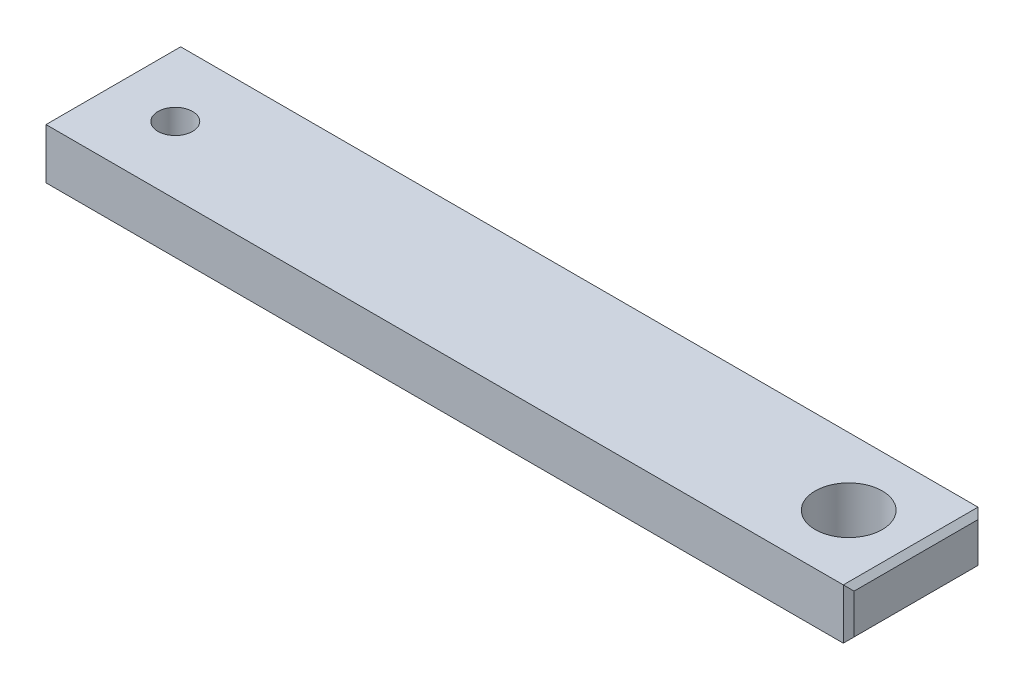
ISO-10303-21;
HEADER;
FILE_DESCRIPTION(('STEP AP214'),'2;1');
FILE_NAME('part.step','',(''),(''),'','','');
FILE_SCHEMA(('AUTOMOTIVE_DESIGN { 1 0 10303 214 1 1 1 1 }'));
ENDSEC;
DATA;
#1=APPLICATION_CONTEXT('core data for automotive mechanical design processes');
#2=APPLICATION_PROTOCOL_DEFINITION('international standard','automotive_design',2000,#1);
#3=PRODUCT_CONTEXT('',#1,'mechanical');
#4=PRODUCT('Part','Part','',(#3));
#5=PRODUCT_RELATED_PRODUCT_CATEGORY('part','',(#4));
#6=PRODUCT_DEFINITION_FORMATION('','',#4);
#7=PRODUCT_DEFINITION_CONTEXT('part definition',#1,'design');
#8=PRODUCT_DEFINITION('design','',#6,#7);
#9=PRODUCT_DEFINITION_SHAPE('','',#8);
#10=(LENGTH_UNIT() NAMED_UNIT(*) SI_UNIT(.MILLI.,.METRE.));
#11=(NAMED_UNIT(*) PLANE_ANGLE_UNIT() SI_UNIT($,.RADIAN.));
#12=(NAMED_UNIT(*) SI_UNIT($,.STERADIAN.) SOLID_ANGLE_UNIT());
#13=UNCERTAINTY_MEASURE_WITH_UNIT(LENGTH_MEASURE(1.E-05),#10,'distance_accuracy_value','');
#14=(GEOMETRIC_REPRESENTATION_CONTEXT(3) GLOBAL_UNCERTAINTY_ASSIGNED_CONTEXT((#13)) GLOBAL_UNIT_ASSIGNED_CONTEXT((#10,
#11,#12)) REPRESENTATION_CONTEXT('',''));
#15=CARTESIAN_POINT('',(0.,0.,0.));
#16=DIRECTION('',(0.,0.,1.));
#17=DIRECTION('',(1.,0.,0.));
#18=AXIS2_PLACEMENT_3D('',#15,#16,#17);
#19=CARTESIAN_POINT('',(0.,4.7625,6.34999999999999));
#20=DIRECTION('',(0.,0.,-1.));
#21=DIRECTION('',(-1.,0.,0.));
#22=AXIS2_PLACEMENT_3D('',#19,#20,#21);
#23=PLANE('',#22);
#24=DIRECTION('',(1.,0.,0.));
#25=VECTOR('',#24,1.);
#26=CARTESIAN_POINT('',(0.,4.7625,6.34999999999999));
#27=LINE('',#26,#25);
#28=CARTESIAN_POINT('',(-69.342,4.7625,6.34999999999999));
#29=VERTEX_POINT('',#28);
#30=CARTESIAN_POINT('',(5.84199999999999,4.7625,6.34999999999999));
#31=VERTEX_POINT('',#30);
#32=EDGE_CURVE('E185',#29,#31,#27,.T.);
#33=ORIENTED_EDGE('',*,*,#32,.F.);
#34=DIRECTION('',(0.,-1.,0.));
#35=VECTOR('',#34,1.);
#36=CARTESIAN_POINT('',(-69.342,4.7625,6.34999999999999));
#37=LINE('',#36,#35);
#38=CARTESIAN_POINT('',(-69.342,0.,6.34999999999999));
#39=VERTEX_POINT('',#38);
#40=EDGE_CURVE('E143',#29,#39,#37,.T.);
#41=ORIENTED_EDGE('',*,*,#40,.T.);
#42=DIRECTION('',(1.,0.,0.));
#43=VECTOR('',#42,1.);
#44=CARTESIAN_POINT('',(0.,0.,6.34999999999999));
#45=LINE('',#44,#43);
#46=CARTESIAN_POINT('',(5.84199999999999,0.,6.34999999999999));
#47=VERTEX_POINT('',#46);
#48=EDGE_CURVE('E186',#39,#47,#45,.T.);
#49=ORIENTED_EDGE('',*,*,#48,.T.);
#50=DIRECTION('',(0.,1.,0.));
#51=VECTOR('',#50,1.);
#52=CARTESIAN_POINT('',(5.84199999999999,4.7625,6.34999999999999));
#53=LINE('',#52,#51);
#54=EDGE_CURVE('E140',#47,#31,#53,.T.);
#55=ORIENTED_EDGE('',*,*,#54,.T.);
#56=EDGE_LOOP('',(#33,#41,#49,#55));
#57=FACE_BOUND('',#56,.T.);
#58=ADVANCED_FACE('F38',(#57),#23,.F.);
#59=CARTESIAN_POINT('',(6.34999999999999,4.7625,0.));
#60=DIRECTION('',(1.,0.,0.));
#61=DIRECTION('',(0.,0.,-1.));
#62=AXIS2_PLACEMENT_3D('',#59,#60,#61);
#63=PLANE('',#62);
#64=DIRECTION('',(0.,0.,1.));
#65=VECTOR('',#64,1.);
#66=CARTESIAN_POINT('',(6.34999999999999,4.25449999999999,0.));
#67=LINE('',#66,#65);
#68=CARTESIAN_POINT('',(6.34999999999999,4.25449999999999,-5.84199999999999));
#69=VERTEX_POINT('',#68);
#70=CARTESIAN_POINT('',(6.34999999999997,4.25449999999999,5.84199999999999));
#71=VERTEX_POINT('',#70);
#72=EDGE_CURVE('E47',#69,#71,#67,.T.);
#73=ORIENTED_EDGE('',*,*,#72,.T.);
#74=DIRECTION('',(0.,-1.,0.));
#75=VECTOR('',#74,1.);
#76=CARTESIAN_POINT('',(6.34999999999997,0.,5.84199999999999));
#77=LINE('',#76,#75);
#78=CARTESIAN_POINT('',(6.34999999999997,0.508000000000008,5.84199999999999));
#79=VERTEX_POINT('',#78);
#80=EDGE_CURVE('E11',#71,#79,#77,.T.);
#81=ORIENTED_EDGE('',*,*,#80,.T.);
#82=DIRECTION('',(0.,0.,-1.));
#83=VECTOR('',#82,1.);
#84=CARTESIAN_POINT('',(6.34999999999999,0.508000000000008,-6.34999999999999));
#85=LINE('',#84,#83);
#86=CARTESIAN_POINT('',(6.34999999999999,0.508000000000008,-5.84199999999999));
#87=VERTEX_POINT('',#86);
#88=EDGE_CURVE('E149',#79,#87,#85,.T.);
#89=ORIENTED_EDGE('',*,*,#88,.T.);
#90=DIRECTION('',(0.,1.,0.));
#91=VECTOR('',#90,1.);
#92=CARTESIAN_POINT('',(6.34999999999999,4.7625,-5.84199999999999));
#93=LINE('',#92,#91);
#94=EDGE_CURVE('E58',#87,#69,#93,.T.);
#95=ORIENTED_EDGE('',*,*,#94,.T.);
#96=EDGE_LOOP('',(#73,#81,#89,#95));
#97=FACE_BOUND('',#96,.T.);
#98=ADVANCED_FACE('F238',(#97),#63,.T.);
#99=CARTESIAN_POINT('',(0.,4.7625,-6.34999999999999));
#100=DIRECTION('',(0.,0.,-1.));
#101=DIRECTION('',(-1.,0.,0.));
#102=AXIS2_PLACEMENT_3D('',#99,#100,#101);
#103=PLANE('',#102);
#104=DIRECTION('',(1.,0.,0.));
#105=VECTOR('',#104,1.);
#106=CARTESIAN_POINT('',(0.,0.,-6.34999999999999));
#107=LINE('',#106,#105);
#108=CARTESIAN_POINT('',(-69.342,0.,-6.34999999999999));
#109=VERTEX_POINT('',#108);
#110=CARTESIAN_POINT('',(5.84199999999999,0.,-6.34999999999999));
#111=VERTEX_POINT('',#110);
#112=EDGE_CURVE('E179',#109,#111,#107,.T.);
#113=ORIENTED_EDGE('',*,*,#112,.F.);
#114=DIRECTION('',(0.,1.,0.));
#115=VECTOR('',#114,1.);
#116=CARTESIAN_POINT('',(-69.342,4.7625,-6.34999999999999));
#117=LINE('',#116,#115);
#118=CARTESIAN_POINT('',(-69.342,4.7625,-6.34999999999999));
#119=VERTEX_POINT('',#118);
#120=EDGE_CURVE('E110',#109,#119,#117,.T.);
#121=ORIENTED_EDGE('',*,*,#120,.T.);
#122=DIRECTION('',(1.,0.,0.));
#123=VECTOR('',#122,1.);
#124=CARTESIAN_POINT('',(0.,4.7625,-6.34999999999999));
#125=LINE('',#124,#123);
#126=CARTESIAN_POINT('',(5.84199999999999,4.7625,-6.34999999999999));
#127=VERTEX_POINT('',#126);
#128=EDGE_CURVE('E123',#119,#127,#125,.T.);
#129=ORIENTED_EDGE('',*,*,#128,.T.);
#130=DIRECTION('',(0.,-1.,0.));
#131=VECTOR('',#130,1.);
#132=CARTESIAN_POINT('',(5.84199999999999,4.7625,-6.34999999999999));
#133=LINE('',#132,#131);
#134=EDGE_CURVE('E129',#127,#111,#133,.T.);
#135=ORIENTED_EDGE('',*,*,#134,.T.);
#136=EDGE_LOOP('',(#113,#121,#129,#135));
#137=FACE_BOUND('',#136,.T.);
#138=ADVANCED_FACE('F178',(#137),#103,.T.);
#139=CARTESIAN_POINT('',(-69.85,4.7625,0.));
#140=DIRECTION('',(1.,0.,0.));
#141=DIRECTION('',(0.,0.,-1.));
#142=AXIS2_PLACEMENT_3D('',#139,#140,#141);
#143=PLANE('',#142);
#144=DIRECTION('',(0.,0.,-1.));
#145=VECTOR('',#144,1.);
#146=CARTESIAN_POINT('',(-69.85,4.2545,-6.35000000000001));
#147=LINE('',#146,#145);
#148=CARTESIAN_POINT('',(-69.85,4.2545,5.84200000000001));
#149=VERTEX_POINT('',#148);
#150=CARTESIAN_POINT('',(-69.85,4.2545,-5.842));
#151=VERTEX_POINT('',#150);
#152=EDGE_CURVE('E127',#149,#151,#147,.T.);
#153=ORIENTED_EDGE('',*,*,#152,.T.);
#154=DIRECTION('',(0.,-1.,0.));
#155=VECTOR('',#154,1.);
#156=CARTESIAN_POINT('',(-69.85,0.,-5.842));
#157=LINE('',#156,#155);
#158=CARTESIAN_POINT('',(-69.85,0.507999999999995,-5.842));
#159=VERTEX_POINT('',#158);
#160=EDGE_CURVE('E108',#151,#159,#157,.T.);
#161=ORIENTED_EDGE('',*,*,#160,.T.);
#162=DIRECTION('',(0.,0.,1.));
#163=VECTOR('',#162,1.);
#164=CARTESIAN_POINT('',(-69.85,0.507999999999995,0.));
#165=LINE('',#164,#163);
#166=CARTESIAN_POINT('',(-69.85,0.507999999999995,5.84200000000001));
#167=VERTEX_POINT('',#166);
#168=EDGE_CURVE('E116',#159,#167,#165,.T.);
#169=ORIENTED_EDGE('',*,*,#168,.T.);
#170=DIRECTION('',(0.,1.,0.));
#171=VECTOR('',#170,1.);
#172=CARTESIAN_POINT('',(-69.85,4.7625,5.84200000000001));
#173=LINE('',#172,#171);
#174=EDGE_CURVE('E122',#167,#149,#173,.T.);
#175=ORIENTED_EDGE('',*,*,#174,.T.);
#176=EDGE_LOOP('',(#153,#161,#169,#175));
#177=FACE_BOUND('',#176,.T.);
#178=ADVANCED_FACE('F125',(#177),#143,.F.);
#179=CARTESIAN_POINT('',(0.,4.7625,0.));
#180=DIRECTION('',(0.,1.,0.));
#181=DIRECTION('',(0.,0.,1.));
#182=AXIS2_PLACEMENT_3D('',#179,#180,#181);
#183=PLANE('',#182);
#184=CARTESIAN_POINT('',(0.,4.7625,0.));
#185=DIRECTION('',(0.,1.,0.));
#186=DIRECTION('',(0.,0.,1.));
#187=AXIS2_PLACEMENT_3D('',#184,#185,#186);
#188=CIRCLE('',#187,3.1623);
#189=CARTESIAN_POINT('',(0.,4.7625,3.1623));
#190=VERTEX_POINT('',#189);
#191=EDGE_CURVE('E158',#190,#190,#188,.T.);
#192=ORIENTED_EDGE('',*,*,#191,.F.);
#193=EDGE_LOOP('',(#192));
#194=FACE_BOUND('',#193,.T.);
#195=CARTESIAN_POINT('',(-63.5,4.7625,0.));
#196=DIRECTION('',(0.,1.,0.));
#197=DIRECTION('',(0.,0.,1.));
#198=AXIS2_PLACEMENT_3D('',#195,#196,#197);
#199=CIRCLE('',#198,1.63195);
#200=CARTESIAN_POINT('',(-63.5,4.7625,1.63195));
#201=VERTEX_POINT('',#200);
#202=EDGE_CURVE('E206',#201,#201,#199,.T.);
#203=ORIENTED_EDGE('',*,*,#202,.F.);
#204=EDGE_LOOP('',(#203));
#205=FACE_BOUND('',#204,.T.);
#206=ORIENTED_EDGE('',*,*,#128,.F.);
#207=DIRECTION('',(0.,0.,1.));
#208=VECTOR('',#207,1.);
#209=CARTESIAN_POINT('',(-69.342,4.7625,6.34999999999999));
#210=LINE('',#209,#208);
#211=EDGE_CURVE('E138',#119,#29,#210,.T.);
#212=ORIENTED_EDGE('',*,*,#211,.T.);
#213=ORIENTED_EDGE('',*,*,#32,.T.);
#214=DIRECTION('',(0.,0.,-1.));
#215=VECTOR('',#214,1.);
#216=CARTESIAN_POINT('',(5.84200000000001,4.7625,0.));
#217=LINE('',#216,#215);
#218=EDGE_CURVE('E136',#31,#127,#217,.T.);
#219=ORIENTED_EDGE('',*,*,#218,.T.);
#220=EDGE_LOOP('',(#206,#212,#213,#219));
#221=FACE_BOUND('',#220,.T.);
#222=ADVANCED_FACE('F202',(#194,#205,#221),#183,.T.);
#223=CARTESIAN_POINT('',(0.,0.,0.));
#224=DIRECTION('',(0.,1.,0.));
#225=DIRECTION('',(0.,0.,1.));
#226=AXIS2_PLACEMENT_3D('',#223,#224,#225);
#227=PLANE('',#226);
#228=CARTESIAN_POINT('',(0.,0.,0.));
#229=DIRECTION('',(0.,1.,0.));
#230=DIRECTION('',(0.,0.,1.));
#231=AXIS2_PLACEMENT_3D('',#228,#229,#230);
#232=CIRCLE('',#231,3.1623);
#233=CARTESIAN_POINT('',(0.,0.,3.1623));
#234=VERTEX_POINT('',#233);
#235=EDGE_CURVE('E209',#234,#234,#232,.T.);
#236=ORIENTED_EDGE('',*,*,#235,.T.);
#237=EDGE_LOOP('',(#236));
#238=FACE_BOUND('',#237,.T.);
#239=CARTESIAN_POINT('',(-63.5,0.,0.));
#240=DIRECTION('',(0.,1.,0.));
#241=DIRECTION('',(0.,0.,1.));
#242=AXIS2_PLACEMENT_3D('',#239,#240,#241);
#243=CIRCLE('',#242,1.63195);
#244=CARTESIAN_POINT('',(-63.5,0.,1.63195));
#245=VERTEX_POINT('',#244);
#246=EDGE_CURVE('E190',#245,#245,#243,.T.);
#247=ORIENTED_EDGE('',*,*,#246,.T.);
#248=EDGE_LOOP('',(#247));
#249=FACE_BOUND('',#248,.T.);
#250=ORIENTED_EDGE('',*,*,#48,.F.);
#251=DIRECTION('',(0.,0.,-1.));
#252=VECTOR('',#251,1.);
#253=CARTESIAN_POINT('',(-69.342,0.,0.));
#254=LINE('',#253,#252);
#255=EDGE_CURVE('E147',#39,#109,#254,.T.);
#256=ORIENTED_EDGE('',*,*,#255,.T.);
#257=ORIENTED_EDGE('',*,*,#112,.T.);
#258=DIRECTION('',(0.,0.,1.));
#259=VECTOR('',#258,1.);
#260=CARTESIAN_POINT('',(5.84199999999999,0.,6.34999999999999));
#261=LINE('',#260,#259);
#262=EDGE_CURVE('E145',#111,#47,#261,.T.);
#263=ORIENTED_EDGE('',*,*,#262,.T.);
#264=EDGE_LOOP('',(#250,#256,#257,#263));
#265=FACE_BOUND('',#264,.T.);
#266=ADVANCED_FACE('F183',(#238,#249,#265),#227,.F.);
#267=CARTESIAN_POINT('',(-63.5,4.7625,0.));
#268=DIRECTION('',(0.,1.,0.));
#269=DIRECTION('',(0.,0.,1.));
#270=AXIS2_PLACEMENT_3D('',#267,#268,#269);
#271=CYLINDRICAL_SURFACE('',#270,1.63195);
#272=ORIENTED_EDGE('',*,*,#246,.F.);
#273=EDGE_LOOP('',(#272));
#274=FACE_BOUND('',#273,.T.);
#275=ORIENTED_EDGE('',*,*,#202,.T.);
#276=EDGE_LOOP('',(#275));
#277=FACE_BOUND('',#276,.T.);
#278=ADVANCED_FACE('F220',(#274,#277),#271,.F.);
#279=CARTESIAN_POINT('',(0.,0.,0.));
#280=DIRECTION('',(0.,1.,0.));
#281=DIRECTION('',(0.,0.,1.));
#282=AXIS2_PLACEMENT_3D('',#279,#280,#281);
#283=CYLINDRICAL_SURFACE('',#282,3.1623);
#284=ORIENTED_EDGE('',*,*,#235,.F.);
#285=EDGE_LOOP('',(#284));
#286=FACE_BOUND('',#285,.T.);
#287=ORIENTED_EDGE('',*,*,#191,.T.);
#288=EDGE_LOOP('',(#287));
#289=FACE_BOUND('',#288,.T.);
#290=ADVANCED_FACE('F217',(#286,#289),#283,.F.);
#291=CARTESIAN_POINT('',(-69.342,4.7625,6.34999999999999));
#292=DIRECTION('',(0.707106781186538,0.,-0.707106781186556));
#293=DIRECTION('',(0.,-1.,0.));
#294=AXIS2_PLACEMENT_3D('',#291,#292,#293);
#295=PLANE('',#294);
#296=DIRECTION('',(-0.577350269189631,0.577350269189631,-0.577350269189616));
#297=VECTOR('',#296,1.);
#298=CARTESIAN_POINT('',(-71.7973333333333,2.45533333333331,3.89466666666674));
#299=LINE('',#298,#297);
#300=EDGE_CURVE('E119',#39,#167,#299,.T.);
#301=ORIENTED_EDGE('',*,*,#300,.F.);
#302=ORIENTED_EDGE('',*,*,#40,.F.);
#303=DIRECTION('',(0.577350269189631,0.577350269189631,0.577350269189616));
#304=VECTOR('',#303,1.);
#305=CARTESIAN_POINT('',(-69.342,4.76250000000001,6.34999999999999));
#306=LINE('',#305,#304);
#307=EDGE_CURVE('E155',#149,#29,#306,.T.);
#308=ORIENTED_EDGE('',*,*,#307,.F.);
#309=ORIENTED_EDGE('',*,*,#174,.F.);
#310=EDGE_LOOP('',(#301,#302,#308,#309));
#311=FACE_BOUND('',#310,.T.);
#312=ADVANCED_FACE('F196',(#311),#295,.F.);
#313=CARTESIAN_POINT('',(-69.342,4.7625,0.));
#314=DIRECTION('',(-0.707106781186548,0.707106781186547,0.));
#315=DIRECTION('',(0.,0.,-1.));
#316=AXIS2_PLACEMENT_3D('',#313,#314,#315);
#317=PLANE('',#316);
#318=ORIENTED_EDGE('',*,*,#307,.T.);
#319=ORIENTED_EDGE('',*,*,#211,.F.);
#320=DIRECTION('',(-0.577350269189631,-0.577350269189631,0.577350269189616));
#321=VECTOR('',#320,1.);
#322=CARTESIAN_POINT('',(-71.4586666666666,2.64583333333335,-4.23333333333339));
#323=LINE('',#322,#321);
#324=EDGE_CURVE('E113',#151,#119,#323,.F.);
#325=ORIENTED_EDGE('',*,*,#324,.F.);
#326=ORIENTED_EDGE('',*,*,#152,.F.);
#327=EDGE_LOOP('',(#318,#319,#325,#326));
#328=FACE_BOUND('',#327,.T.);
#329=ADVANCED_FACE('F199',(#328),#317,.T.);
#330=CARTESIAN_POINT('',(-69.85,0.507999999999995,0.));
#331=DIRECTION('',(0.707106781186548,0.707106781186547,0.));
#332=DIRECTION('',(0.,0.,1.));
#333=AXIS2_PLACEMENT_3D('',#330,#331,#332);
#334=PLANE('',#333);
#335=ORIENTED_EDGE('',*,*,#300,.T.);
#336=ORIENTED_EDGE('',*,*,#168,.F.);
#337=DIRECTION('',(-0.577350269189631,0.577350269189631,0.577350269189616));
#338=VECTOR('',#337,1.);
#339=CARTESIAN_POINT('',(-71.7973333333333,2.45533333333331,-3.89466666666674));
#340=LINE('',#339,#338);
#341=EDGE_CURVE('E104',#109,#159,#340,.T.);
#342=ORIENTED_EDGE('',*,*,#341,.F.);
#343=ORIENTED_EDGE('',*,*,#255,.F.);
#344=EDGE_LOOP('',(#335,#336,#342,#343));
#345=FACE_BOUND('',#344,.T.);
#346=ADVANCED_FACE('F117',(#345),#334,.F.);
#347=CARTESIAN_POINT('',(-69.85,4.7625,-5.842));
#348=DIRECTION('',(-0.707106781186538,0.,-0.707106781186556));
#349=DIRECTION('',(0.,1.,0.));
#350=AXIS2_PLACEMENT_3D('',#347,#348,#349);
#351=PLANE('',#350);
#352=ORIENTED_EDGE('',*,*,#324,.T.);
#353=ORIENTED_EDGE('',*,*,#120,.F.);
#354=ORIENTED_EDGE('',*,*,#341,.T.);
#355=ORIENTED_EDGE('',*,*,#160,.F.);
#356=EDGE_LOOP('',(#352,#353,#354,#355));
#357=FACE_BOUND('',#356,.T.);
#358=ADVANCED_FACE('F106',(#357),#351,.T.);
#359=CARTESIAN_POINT('',(5.84199999999999,4.7625,-6.34999999999999));
#360=DIRECTION('',(-0.707106781186552,0.,0.707106781186543));
#361=DIRECTION('',(0.,-1.,0.));
#362=AXIS2_PLACEMENT_3D('',#359,#360,#361);
#363=PLANE('',#362);
#364=DIRECTION('',(-0.57735026918962,-0.577350269189628,-0.577350269189628));
#365=VECTOR('',#364,1.);
#366=CARTESIAN_POINT('',(7.95866666666664,2.11666666666669,-4.23333333333331));
#367=LINE('',#366,#365);
#368=EDGE_CURVE('E162',#111,#87,#367,.F.);
#369=ORIENTED_EDGE('',*,*,#368,.F.);
#370=ORIENTED_EDGE('',*,*,#134,.F.);
#371=DIRECTION('',(0.57735026918962,-0.577350269189628,0.577350269189628));
#372=VECTOR('',#371,1.);
#373=CARTESIAN_POINT('',(5.84199999999999,4.7625,-6.34999999999999));
#374=LINE('',#373,#372);
#375=EDGE_CURVE('E42',#69,#127,#374,.F.);
#376=ORIENTED_EDGE('',*,*,#375,.F.);
#377=ORIENTED_EDGE('',*,*,#94,.F.);
#378=EDGE_LOOP('',(#369,#370,#376,#377));
#379=FACE_BOUND('',#378,.T.);
#380=ADVANCED_FACE('F40',(#379),#363,.F.);
#381=CARTESIAN_POINT('',(6.34999999999999,4.25449999999999,0.));
#382=DIRECTION('',(-0.707106781186552,-0.707106781186543,0.));
#383=DIRECTION('',(0.,0.,1.));
#384=AXIS2_PLACEMENT_3D('',#381,#382,#383);
#385=PLANE('',#384);
#386=ORIENTED_EDGE('',*,*,#375,.T.);
#387=ORIENTED_EDGE('',*,*,#218,.F.);
#388=DIRECTION('',(-0.57735026918962,0.577350269189628,0.577350269189628));
#389=VECTOR('',#388,1.);
#390=CARTESIAN_POINT('',(8.29733333333332,2.30716666666664,3.89466666666664));
#391=LINE('',#390,#389);
#392=EDGE_CURVE('E161',#71,#31,#391,.T.);
#393=ORIENTED_EDGE('',*,*,#392,.F.);
#394=ORIENTED_EDGE('',*,*,#72,.F.);
#395=EDGE_LOOP('',(#386,#387,#393,#394));
#396=FACE_BOUND('',#395,.T.);
#397=ADVANCED_FACE('F171',(#396),#385,.F.);
#398=CARTESIAN_POINT('',(5.84200000000001,0.,0.));
#399=DIRECTION('',(0.707106781186552,-0.707106781186543,0.));
#400=DIRECTION('',(0.,0.,-1.));
#401=AXIS2_PLACEMENT_3D('',#398,#399,#400);
#402=PLANE('',#401);
#403=ORIENTED_EDGE('',*,*,#368,.T.);
#404=ORIENTED_EDGE('',*,*,#88,.F.);
#405=DIRECTION('',(-0.57735026918962,-0.577350269189628,0.577350269189628));
#406=VECTOR('',#405,1.);
#407=CARTESIAN_POINT('',(7.95866666666664,2.11666666666669,4.23333333333331));
#408=LINE('',#407,#406);
#409=EDGE_CURVE('E159',#47,#79,#408,.F.);
#410=ORIENTED_EDGE('',*,*,#409,.F.);
#411=ORIENTED_EDGE('',*,*,#262,.F.);
#412=EDGE_LOOP('',(#403,#404,#410,#411));
#413=FACE_BOUND('',#412,.T.);
#414=ADVANCED_FACE('F258',(#413),#402,.T.);
#415=CARTESIAN_POINT('',(6.34999999999997,4.7625,5.84199999999999));
#416=DIRECTION('',(0.707106781186552,0.,0.707106781186543));
#417=DIRECTION('',(0.,1.,0.));
#418=AXIS2_PLACEMENT_3D('',#415,#416,#417);
#419=PLANE('',#418);
#420=ORIENTED_EDGE('',*,*,#392,.T.);
#421=ORIENTED_EDGE('',*,*,#54,.F.);
#422=ORIENTED_EDGE('',*,*,#409,.T.);
#423=ORIENTED_EDGE('',*,*,#80,.F.);
#424=EDGE_LOOP('',(#420,#421,#422,#423));
#425=FACE_BOUND('',#424,.T.);
#426=ADVANCED_FACE('F255',(#425),#419,.T.);
#427=CLOSED_SHELL('',(#58,#98,#138,#178,#222,#266,#278,#290,#312,#329,#346,#358,#380,#397,#414,#426));
#428=MANIFOLD_SOLID_BREP('B2',#427);
#429=ADVANCED_BREP_SHAPE_REPRESENTATION('',(#18,#428),#14);
#430=SHAPE_DEFINITION_REPRESENTATION(#9,#429);
ENDSEC;
END-ISO-10303-21;
